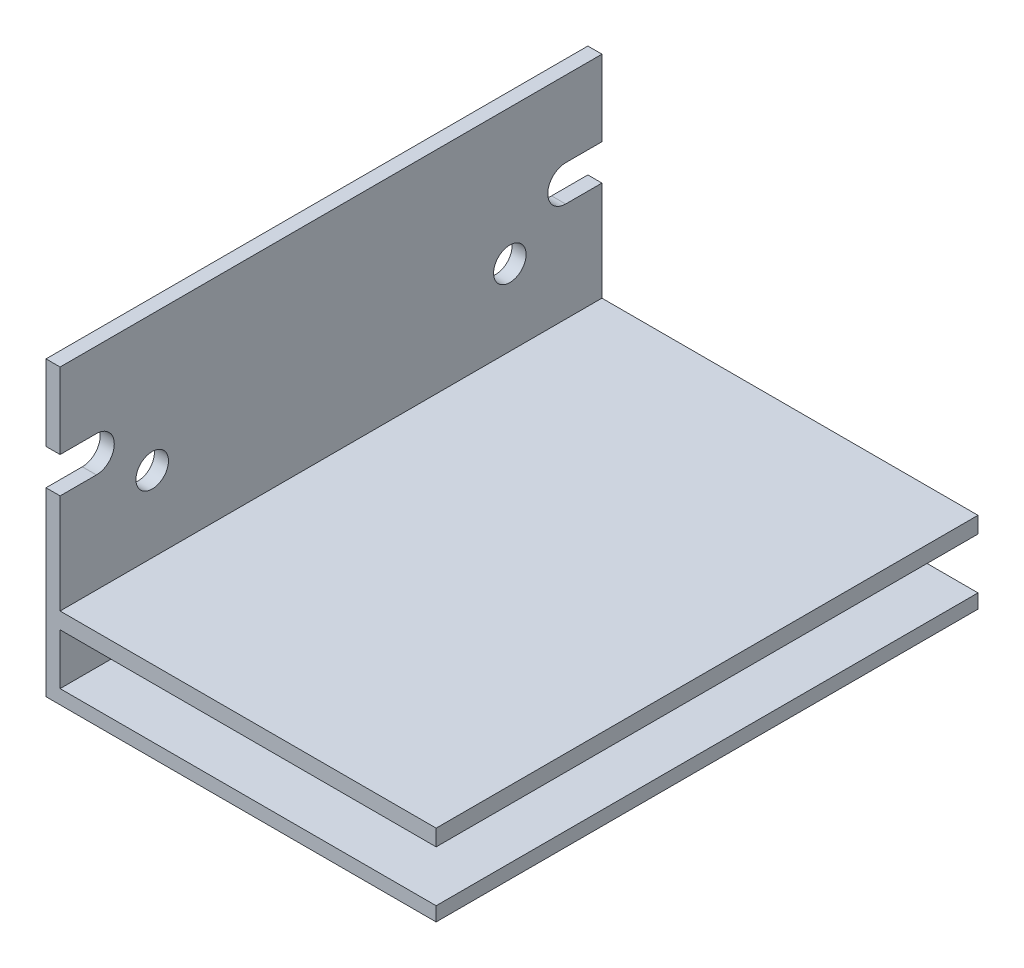
ISO-10303-21;
HEADER;
FILE_DESCRIPTION(('STEP AP214'),'2;1');
FILE_NAME('part.step','',(''),(''),'','','');
FILE_SCHEMA(('AUTOMOTIVE_DESIGN { 1 0 10303 214 1 1 1 1 }'));
ENDSEC;
DATA;
#1=APPLICATION_CONTEXT('core data for automotive mechanical design processes');
#2=APPLICATION_PROTOCOL_DEFINITION('international standard','automotive_design',2000,#1);
#3=PRODUCT_CONTEXT('',#1,'mechanical');
#4=PRODUCT('Part','Part','',(#3));
#5=PRODUCT_RELATED_PRODUCT_CATEGORY('part','',(#4));
#6=PRODUCT_DEFINITION_FORMATION('','',#4);
#7=PRODUCT_DEFINITION_CONTEXT('part definition',#1,'design');
#8=PRODUCT_DEFINITION('design','',#6,#7);
#9=PRODUCT_DEFINITION_SHAPE('','',#8);
#10=(LENGTH_UNIT() NAMED_UNIT(*) SI_UNIT(.MILLI.,.METRE.));
#11=(NAMED_UNIT(*) PLANE_ANGLE_UNIT() SI_UNIT($,.RADIAN.));
#12=(NAMED_UNIT(*) SI_UNIT($,.STERADIAN.) SOLID_ANGLE_UNIT());
#13=UNCERTAINTY_MEASURE_WITH_UNIT(LENGTH_MEASURE(1.E-05),#10,'distance_accuracy_value','');
#14=(GEOMETRIC_REPRESENTATION_CONTEXT(3) GLOBAL_UNCERTAINTY_ASSIGNED_CONTEXT((#13)) GLOBAL_UNIT_ASSIGNED_CONTEXT((#10,
#11,#12)) REPRESENTATION_CONTEXT('',''));
#15=CARTESIAN_POINT('',(0.,0.,0.));
#16=DIRECTION('',(0.,0.,1.));
#17=DIRECTION('',(1.,0.,0.));
#18=AXIS2_PLACEMENT_3D('',#15,#16,#17);
#19=CARTESIAN_POINT('',(0.,0.,50.));
#20=DIRECTION('',(0.,0.,-1.));
#21=DIRECTION('',(-1.,0.,0.));
#22=AXIS2_PLACEMENT_3D('',#19,#20,#21);
#23=PLANE('',#22);
#24=DIRECTION('',(0.,-1.,0.));
#25=VECTOR('',#24,1.);
#26=CARTESIAN_POINT('',(0.,0.,50.));
#27=LINE('',#26,#25);
#28=CARTESIAN_POINT('',(0.,27.,50.));
#29=VERTEX_POINT('',#28);
#30=CARTESIAN_POINT('',(0.,20.,50.));
#31=VERTEX_POINT('',#30);
#32=EDGE_CURVE('E242',#29,#31,#27,.T.);
#33=ORIENTED_EDGE('',*,*,#32,.T.);
#34=DIRECTION('',(1.,0.,0.));
#35=VECTOR('',#34,1.);
#36=CARTESIAN_POINT('',(0.,20.,50.));
#37=LINE('',#36,#35);
#38=CARTESIAN_POINT('',(1.3,20.,50.));
#39=VERTEX_POINT('',#38);
#40=EDGE_CURVE('E11',#31,#39,#37,.T.);
#41=ORIENTED_EDGE('',*,*,#40,.T.);
#42=DIRECTION('',(0.,1.,0.));
#43=VECTOR('',#42,1.);
#44=CARTESIAN_POINT('',(1.3,27.,50.));
#45=LINE('',#44,#43);
#46=CARTESIAN_POINT('',(1.3,27.,50.));
#47=VERTEX_POINT('',#46);
#48=EDGE_CURVE('E236',#39,#47,#45,.T.);
#49=ORIENTED_EDGE('',*,*,#48,.T.);
#50=DIRECTION('',(-1.,0.,0.));
#51=VECTOR('',#50,1.);
#52=CARTESIAN_POINT('',(0.,27.,50.));
#53=LINE('',#52,#51);
#54=EDGE_CURVE('E240',#47,#29,#53,.T.);
#55=ORIENTED_EDGE('',*,*,#54,.T.);
#56=EDGE_LOOP('',(#33,#41,#49,#55));
#57=FACE_BOUND('',#56,.T.);
#58=ADVANCED_FACE('F35',(#57),#23,.F.);
#59=CARTESIAN_POINT('',(0.,0.,0.));
#60=DIRECTION('',(0.,0.,-1.));
#61=DIRECTION('',(-1.,0.,0.));
#62=AXIS2_PLACEMENT_3D('',#59,#60,#61);
#63=PLANE('',#62);
#64=DIRECTION('',(1.,0.,0.));
#65=VECTOR('',#64,1.);
#66=CARTESIAN_POINT('',(0.,20.,0.));
#67=LINE('',#66,#65);
#68=CARTESIAN_POINT('',(0.,20.,0.));
#69=VERTEX_POINT('',#68);
#70=CARTESIAN_POINT('',(1.3,20.,0.));
#71=VERTEX_POINT('',#70);
#72=EDGE_CURVE('E300',#69,#71,#67,.T.);
#73=ORIENTED_EDGE('',*,*,#72,.F.);
#74=DIRECTION('',(0.,-1.,0.));
#75=VECTOR('',#74,1.);
#76=CARTESIAN_POINT('',(0.,0.,0.));
#77=LINE('',#76,#75);
#78=CARTESIAN_POINT('',(0.,27.,0.));
#79=VERTEX_POINT('',#78);
#80=EDGE_CURVE('E224',#79,#69,#77,.T.);
#81=ORIENTED_EDGE('',*,*,#80,.F.);
#82=DIRECTION('',(-1.,0.,0.));
#83=VECTOR('',#82,1.);
#84=CARTESIAN_POINT('',(0.,27.,0.));
#85=LINE('',#84,#83);
#86=CARTESIAN_POINT('',(1.3,27.,0.));
#87=VERTEX_POINT('',#86);
#88=EDGE_CURVE('E264',#87,#79,#85,.T.);
#89=ORIENTED_EDGE('',*,*,#88,.F.);
#90=DIRECTION('',(0.,1.,0.));
#91=VECTOR('',#90,1.);
#92=CARTESIAN_POINT('',(1.3,27.,0.));
#93=LINE('',#92,#91);
#94=EDGE_CURVE('E260',#71,#87,#93,.T.);
#95=ORIENTED_EDGE('',*,*,#94,.F.);
#96=EDGE_LOOP('',(#73,#81,#89,#95));
#97=FACE_BOUND('',#96,.T.);
#98=ADVANCED_FACE('F321',(#97),#63,.T.);
#99=CARTESIAN_POINT('',(36.,0.,50.));
#100=DIRECTION('',(0.,1.,0.));
#101=DIRECTION('',(-1.,0.,0.));
#102=AXIS2_PLACEMENT_3D('',#99,#100,#101);
#103=PLANE('',#102);
#104=DIRECTION('',(1.,0.,0.));
#105=VECTOR('',#104,1.);
#106=CARTESIAN_POINT('',(36.,0.,0.));
#107=LINE('',#106,#105);
#108=CARTESIAN_POINT('',(0.,0.,0.));
#109=VERTEX_POINT('',#108);
#110=CARTESIAN_POINT('',(36.,0.,0.));
#111=VERTEX_POINT('',#110);
#112=EDGE_CURVE('E219',#109,#111,#107,.T.);
#113=ORIENTED_EDGE('',*,*,#112,.T.);
#114=DIRECTION('',(0.,0.,-1.));
#115=VECTOR('',#114,1.);
#116=CARTESIAN_POINT('',(36.,0.,50.));
#117=LINE('',#116,#115);
#118=CARTESIAN_POINT('',(36.,0.,50.));
#119=VERTEX_POINT('',#118);
#120=EDGE_CURVE('E295',#119,#111,#117,.T.);
#121=ORIENTED_EDGE('',*,*,#120,.F.);
#122=DIRECTION('',(1.,0.,0.));
#123=VECTOR('',#122,1.);
#124=CARTESIAN_POINT('',(36.,0.,50.));
#125=LINE('',#124,#123);
#126=CARTESIAN_POINT('',(0.,0.,50.));
#127=VERTEX_POINT('',#126);
#128=EDGE_CURVE('E220',#127,#119,#125,.T.);
#129=ORIENTED_EDGE('',*,*,#128,.F.);
#130=DIRECTION('',(0.,0.,-1.));
#131=VECTOR('',#130,1.);
#132=CARTESIAN_POINT('',(0.,0.,50.));
#133=LINE('',#132,#131);
#134=EDGE_CURVE('E245',#127,#109,#133,.T.);
#135=ORIENTED_EDGE('',*,*,#134,.T.);
#136=EDGE_LOOP('',(#113,#121,#129,#135));
#137=FACE_BOUND('',#136,.T.);
#138=ADVANCED_FACE('F37',(#137),#103,.F.);
#139=CARTESIAN_POINT('',(36.,1.3,50.));
#140=DIRECTION('',(-1.,0.,0.));
#141=DIRECTION('',(0.,0.,1.));
#142=AXIS2_PLACEMENT_3D('',#139,#140,#141);
#143=PLANE('',#142);
#144=DIRECTION('',(0.,1.,0.));
#145=VECTOR('',#144,1.);
#146=CARTESIAN_POINT('',(36.,1.3,0.));
#147=LINE('',#146,#145);
#148=CARTESIAN_POINT('',(36.,1.3,0.));
#149=VERTEX_POINT('',#148);
#150=EDGE_CURVE('E248',#111,#149,#147,.T.);
#151=ORIENTED_EDGE('',*,*,#150,.T.);
#152=DIRECTION('',(0.,0.,-1.));
#153=VECTOR('',#152,1.);
#154=CARTESIAN_POINT('',(36.,1.3,50.));
#155=LINE('',#154,#153);
#156=CARTESIAN_POINT('',(36.,1.3,50.));
#157=VERTEX_POINT('',#156);
#158=EDGE_CURVE('E292',#157,#149,#155,.T.);
#159=ORIENTED_EDGE('',*,*,#158,.F.);
#160=DIRECTION('',(0.,1.,0.));
#161=VECTOR('',#160,1.);
#162=CARTESIAN_POINT('',(36.,1.3,50.));
#163=LINE('',#162,#161);
#164=EDGE_CURVE('E223',#119,#157,#163,.T.);
#165=ORIENTED_EDGE('',*,*,#164,.F.);
#166=ORIENTED_EDGE('',*,*,#120,.T.);
#167=EDGE_LOOP('',(#151,#159,#165,#166));
#168=FACE_BOUND('',#167,.T.);
#169=ADVANCED_FACE('F344',(#168),#143,.F.);
#170=CARTESIAN_POINT('',(1.3,1.3,50.));
#171=DIRECTION('',(0.,-1.,0.));
#172=DIRECTION('',(1.,0.,0.));
#173=AXIS2_PLACEMENT_3D('',#170,#171,#172);
#174=PLANE('',#173);
#175=DIRECTION('',(-1.,0.,0.));
#176=VECTOR('',#175,1.);
#177=CARTESIAN_POINT('',(1.3,1.3,0.));
#178=LINE('',#177,#176);
#179=CARTESIAN_POINT('',(1.3,1.3,0.));
#180=VERTEX_POINT('',#179);
#181=EDGE_CURVE('E250',#149,#180,#178,.T.);
#182=ORIENTED_EDGE('',*,*,#181,.T.);
#183=DIRECTION('',(0.,0.,-1.));
#184=VECTOR('',#183,1.);
#185=CARTESIAN_POINT('',(1.3,1.3,50.));
#186=LINE('',#185,#184);
#187=CARTESIAN_POINT('',(1.3,1.3,50.));
#188=VERTEX_POINT('',#187);
#189=EDGE_CURVE('E289',#188,#180,#186,.T.);
#190=ORIENTED_EDGE('',*,*,#189,.F.);
#191=DIRECTION('',(-1.,0.,0.));
#192=VECTOR('',#191,1.);
#193=CARTESIAN_POINT('',(1.3,1.3,50.));
#194=LINE('',#193,#192);
#195=EDGE_CURVE('E226',#157,#188,#194,.T.);
#196=ORIENTED_EDGE('',*,*,#195,.F.);
#197=ORIENTED_EDGE('',*,*,#158,.T.);
#198=EDGE_LOOP('',(#182,#190,#196,#197));
#199=FACE_BOUND('',#198,.T.);
#200=ADVANCED_FACE('F346',(#199),#174,.F.);
#201=CARTESIAN_POINT('',(1.3,6.,50.));
#202=DIRECTION('',(-1.,0.,0.));
#203=DIRECTION('',(0.,-1.,0.));
#204=AXIS2_PLACEMENT_3D('',#201,#202,#203);
#205=PLANE('',#204);
#206=DIRECTION('',(0.,1.,0.));
#207=VECTOR('',#206,1.);
#208=CARTESIAN_POINT('',(1.3,6.,0.));
#209=LINE('',#208,#207);
#210=CARTESIAN_POINT('',(1.3,6.,0.));
#211=VERTEX_POINT('',#210);
#212=EDGE_CURVE('E252',#180,#211,#209,.T.);
#213=ORIENTED_EDGE('',*,*,#212,.T.);
#214=DIRECTION('',(0.,0.,-1.));
#215=VECTOR('',#214,1.);
#216=CARTESIAN_POINT('',(1.3,6.,50.));
#217=LINE('',#216,#215);
#218=CARTESIAN_POINT('',(1.3,6.,50.));
#219=VERTEX_POINT('',#218);
#220=EDGE_CURVE('E286',#219,#211,#217,.T.);
#221=ORIENTED_EDGE('',*,*,#220,.F.);
#222=DIRECTION('',(0.,1.,0.));
#223=VECTOR('',#222,1.);
#224=CARTESIAN_POINT('',(1.3,6.,50.));
#225=LINE('',#224,#223);
#226=EDGE_CURVE('E228',#188,#219,#225,.T.);
#227=ORIENTED_EDGE('',*,*,#226,.F.);
#228=ORIENTED_EDGE('',*,*,#189,.T.);
#229=EDGE_LOOP('',(#213,#221,#227,#228));
#230=FACE_BOUND('',#229,.T.);
#231=ADVANCED_FACE('F351',(#230),#205,.F.);
#232=CARTESIAN_POINT('',(36.,6.,50.));
#233=DIRECTION('',(0.,1.,0.));
#234=DIRECTION('',(-1.,0.,0.));
#235=AXIS2_PLACEMENT_3D('',#232,#233,#234);
#236=PLANE('',#235);
#237=DIRECTION('',(1.,0.,0.));
#238=VECTOR('',#237,1.);
#239=CARTESIAN_POINT('',(36.,6.,0.));
#240=LINE('',#239,#238);
#241=CARTESIAN_POINT('',(36.,6.,0.));
#242=VERTEX_POINT('',#241);
#243=EDGE_CURVE('E254',#211,#242,#240,.T.);
#244=ORIENTED_EDGE('',*,*,#243,.T.);
#245=DIRECTION('',(0.,0.,-1.));
#246=VECTOR('',#245,1.);
#247=CARTESIAN_POINT('',(36.,6.,50.));
#248=LINE('',#247,#246);
#249=CARTESIAN_POINT('',(36.,6.,50.));
#250=VERTEX_POINT('',#249);
#251=EDGE_CURVE('E283',#250,#242,#248,.T.);
#252=ORIENTED_EDGE('',*,*,#251,.F.);
#253=DIRECTION('',(1.,0.,0.));
#254=VECTOR('',#253,1.);
#255=CARTESIAN_POINT('',(36.,6.,50.));
#256=LINE('',#255,#254);
#257=EDGE_CURVE('E230',#219,#250,#256,.T.);
#258=ORIENTED_EDGE('',*,*,#257,.F.);
#259=ORIENTED_EDGE('',*,*,#220,.T.);
#260=EDGE_LOOP('',(#244,#252,#258,#259));
#261=FACE_BOUND('',#260,.T.);
#262=ADVANCED_FACE('F357',(#261),#236,.F.);
#263=CARTESIAN_POINT('',(36.,6.,50.));
#264=DIRECTION('',(-1.,0.,0.));
#265=DIRECTION('',(0.,0.,1.));
#266=AXIS2_PLACEMENT_3D('',#263,#264,#265);
#267=PLANE('',#266);
#268=DIRECTION('',(0.,1.,0.));
#269=VECTOR('',#268,1.);
#270=CARTESIAN_POINT('',(36.,6.,0.));
#271=LINE('',#270,#269);
#272=CARTESIAN_POINT('',(36.,7.5,0.));
#273=VERTEX_POINT('',#272);
#274=EDGE_CURVE('E256',#242,#273,#271,.T.);
#275=ORIENTED_EDGE('',*,*,#274,.T.);
#276=DIRECTION('',(0.,0.,-1.));
#277=VECTOR('',#276,1.);
#278=CARTESIAN_POINT('',(36.,7.5,50.));
#279=LINE('',#278,#277);
#280=CARTESIAN_POINT('',(36.,7.5,50.));
#281=VERTEX_POINT('',#280);
#282=EDGE_CURVE('E280',#281,#273,#279,.T.);
#283=ORIENTED_EDGE('',*,*,#282,.F.);
#284=DIRECTION('',(0.,1.,0.));
#285=VECTOR('',#284,1.);
#286=CARTESIAN_POINT('',(36.,6.,50.));
#287=LINE('',#286,#285);
#288=EDGE_CURVE('E232',#250,#281,#287,.T.);
#289=ORIENTED_EDGE('',*,*,#288,.F.);
#290=ORIENTED_EDGE('',*,*,#251,.T.);
#291=EDGE_LOOP('',(#275,#283,#289,#290));
#292=FACE_BOUND('',#291,.T.);
#293=ADVANCED_FACE('F361',(#292),#267,.F.);
#294=CARTESIAN_POINT('',(36.,7.5,50.));
#295=DIRECTION('',(0.,-1.,0.));
#296=DIRECTION('',(1.,0.,0.));
#297=AXIS2_PLACEMENT_3D('',#294,#295,#296);
#298=PLANE('',#297);
#299=DIRECTION('',(-1.,0.,0.));
#300=VECTOR('',#299,1.);
#301=CARTESIAN_POINT('',(36.,7.5,0.));
#302=LINE('',#301,#300);
#303=CARTESIAN_POINT('',(1.3,7.5,0.));
#304=VERTEX_POINT('',#303);
#305=EDGE_CURVE('E258',#273,#304,#302,.T.);
#306=ORIENTED_EDGE('',*,*,#305,.T.);
#307=DIRECTION('',(0.,0.,-1.));
#308=VECTOR('',#307,1.);
#309=CARTESIAN_POINT('',(1.3,7.5,50.));
#310=LINE('',#309,#308);
#311=CARTESIAN_POINT('',(1.3,7.5,50.));
#312=VERTEX_POINT('',#311);
#313=EDGE_CURVE('E277',#312,#304,#310,.T.);
#314=ORIENTED_EDGE('',*,*,#313,.F.);
#315=DIRECTION('',(-1.,0.,0.));
#316=VECTOR('',#315,1.);
#317=CARTESIAN_POINT('',(36.,7.5,50.));
#318=LINE('',#317,#316);
#319=EDGE_CURVE('E234',#281,#312,#318,.T.);
#320=ORIENTED_EDGE('',*,*,#319,.F.);
#321=ORIENTED_EDGE('',*,*,#282,.T.);
#322=EDGE_LOOP('',(#306,#314,#320,#321));
#323=FACE_BOUND('',#322,.T.);
#324=ADVANCED_FACE('F366',(#323),#298,.F.);
#325=CARTESIAN_POINT('',(1.3,27.,50.));
#326=DIRECTION('',(-1.,0.,0.));
#327=DIRECTION('',(0.,-1.,0.));
#328=AXIS2_PLACEMENT_3D('',#325,#326,#327);
#329=PLANE('',#328);
#330=CARTESIAN_POINT('',(1.3,14.5,8.5));
#331=DIRECTION('',(-1.,0.,0.));
#332=DIRECTION('',(0.,-1.,0.));
#333=AXIS2_PLACEMENT_3D('',#330,#331,#332);
#334=CIRCLE('',#333,1.5);
#335=CARTESIAN_POINT('',(1.3,13.,8.5));
#336=VERTEX_POINT('',#335);
#337=EDGE_CURVE('E197',#336,#336,#334,.T.);
#338=ORIENTED_EDGE('',*,*,#337,.T.);
#339=EDGE_LOOP('',(#338));
#340=FACE_BOUND('',#339,.T.);
#341=CARTESIAN_POINT('',(1.3,14.5,41.5));
#342=DIRECTION('',(-1.,0.,0.));
#343=DIRECTION('',(0.,-1.,0.));
#344=AXIS2_PLACEMENT_3D('',#341,#342,#343);
#345=CIRCLE('',#344,1.5);
#346=CARTESIAN_POINT('',(1.3,13.,41.5));
#347=VERTEX_POINT('',#346);
#348=EDGE_CURVE('E194',#347,#347,#345,.T.);
#349=ORIENTED_EDGE('',*,*,#348,.T.);
#350=EDGE_LOOP('',(#349));
#351=FACE_BOUND('',#350,.T.);
#352=ORIENTED_EDGE('',*,*,#48,.F.);
#353=DIRECTION('',(0.,0.,-1.));
#354=VECTOR('',#353,1.);
#355=CARTESIAN_POINT('',(1.3,20.,50.));
#356=LINE('',#355,#354);
#357=CARTESIAN_POINT('',(1.3,20.,46.65));
#358=VERTEX_POINT('',#357);
#359=EDGE_CURVE('E188',#39,#358,#356,.T.);
#360=ORIENTED_EDGE('',*,*,#359,.T.);
#361=CARTESIAN_POINT('',(1.3,18.35,46.65));
#362=DIRECTION('',(-1.,0.,0.));
#363=DIRECTION('',(0.,-1.,0.));
#364=AXIS2_PLACEMENT_3D('',#361,#362,#363);
#365=CIRCLE('',#364,1.65);
#366=CARTESIAN_POINT('',(1.3,16.7,46.65));
#367=VERTEX_POINT('',#366);
#368=EDGE_CURVE('E192',#358,#367,#365,.T.);
#369=ORIENTED_EDGE('',*,*,#368,.T.);
#370=DIRECTION('',(0.,0.,1.));
#371=VECTOR('',#370,1.);
#372=CARTESIAN_POINT('',(1.3,16.7,50.));
#373=LINE('',#372,#371);
#374=CARTESIAN_POINT('',(1.3,16.7,50.));
#375=VERTEX_POINT('',#374);
#376=EDGE_CURVE('E163',#367,#375,#373,.T.);
#377=ORIENTED_EDGE('',*,*,#376,.T.);
#378=EDGE_CURVE('E237',#312,#375,#45,.T.);
#379=ORIENTED_EDGE('',*,*,#378,.F.);
#380=ORIENTED_EDGE('',*,*,#313,.T.);
#381=CARTESIAN_POINT('',(1.3,16.7,0.));
#382=VERTEX_POINT('',#381);
#383=EDGE_CURVE('E261',#304,#382,#93,.T.);
#384=ORIENTED_EDGE('',*,*,#383,.T.);
#385=DIRECTION('',(0.,0.,1.));
#386=VECTOR('',#385,1.);
#387=CARTESIAN_POINT('',(1.3,16.7,50.));
#388=LINE('',#387,#386);
#389=CARTESIAN_POINT('',(1.3,16.7,3.35));
#390=VERTEX_POINT('',#389);
#391=EDGE_CURVE('E58',#382,#390,#388,.T.);
#392=ORIENTED_EDGE('',*,*,#391,.T.);
#393=CARTESIAN_POINT('',(1.3,18.35,3.35));
#394=DIRECTION('',(-1.,0.,0.));
#395=DIRECTION('',(0.,-1.,0.));
#396=AXIS2_PLACEMENT_3D('',#393,#394,#395);
#397=CIRCLE('',#396,1.65);
#398=CARTESIAN_POINT('',(1.3,20.,3.35));
#399=VERTEX_POINT('',#398);
#400=EDGE_CURVE('E216',#390,#399,#397,.T.);
#401=ORIENTED_EDGE('',*,*,#400,.T.);
#402=DIRECTION('',(0.,0.,-1.));
#403=VECTOR('',#402,1.);
#404=CARTESIAN_POINT('',(1.3,20.,50.));
#405=LINE('',#404,#403);
#406=EDGE_CURVE('E213',#399,#71,#405,.T.);
#407=ORIENTED_EDGE('',*,*,#406,.T.);
#408=ORIENTED_EDGE('',*,*,#94,.T.);
#409=DIRECTION('',(0.,0.,-1.));
#410=VECTOR('',#409,1.);
#411=CARTESIAN_POINT('',(1.3,27.,50.));
#412=LINE('',#411,#410);
#413=EDGE_CURVE('E274',#47,#87,#412,.T.);
#414=ORIENTED_EDGE('',*,*,#413,.F.);
#415=EDGE_LOOP('',(#352,#360,#369,#377,#379,#380,#384,#392,#401,#407,#408,#414));
#416=FACE_BOUND('',#415,.T.);
#417=ADVANCED_FACE('F306',(#340,#351,#416),#329,.F.);
#418=CARTESIAN_POINT('',(0.,27.,50.));
#419=DIRECTION('',(0.,-1.,0.));
#420=DIRECTION('',(0.,0.,-1.));
#421=AXIS2_PLACEMENT_3D('',#418,#419,#420);
#422=PLANE('',#421);
#423=ORIENTED_EDGE('',*,*,#88,.T.);
#424=DIRECTION('',(0.,0.,-1.));
#425=VECTOR('',#424,1.);
#426=CARTESIAN_POINT('',(0.,27.,50.));
#427=LINE('',#426,#425);
#428=EDGE_CURVE('E271',#29,#79,#427,.T.);
#429=ORIENTED_EDGE('',*,*,#428,.F.);
#430=ORIENTED_EDGE('',*,*,#54,.F.);
#431=ORIENTED_EDGE('',*,*,#413,.T.);
#432=EDGE_LOOP('',(#423,#429,#430,#431));
#433=FACE_BOUND('',#432,.T.);
#434=ADVANCED_FACE('F315',(#433),#422,.F.);
#435=CARTESIAN_POINT('',(0.,0.,50.));
#436=DIRECTION('',(1.,0.,0.));
#437=DIRECTION('',(0.,0.,-1.));
#438=AXIS2_PLACEMENT_3D('',#435,#436,#437);
#439=PLANE('',#438);
#440=CARTESIAN_POINT('',(0.,14.5,8.5));
#441=DIRECTION('',(-1.,0.,0.));
#442=DIRECTION('',(0.,0.,1.));
#443=AXIS2_PLACEMENT_3D('',#440,#441,#442);
#444=CIRCLE('',#443,1.5);
#445=CARTESIAN_POINT('',(0.,14.5,10.));
#446=VERTEX_POINT('',#445);
#447=EDGE_CURVE('E189',#446,#446,#444,.T.);
#448=ORIENTED_EDGE('',*,*,#447,.F.);
#449=EDGE_LOOP('',(#448));
#450=FACE_BOUND('',#449,.T.);
#451=CARTESIAN_POINT('',(0.,14.5,41.5));
#452=DIRECTION('',(-1.,0.,0.));
#453=DIRECTION('',(0.,0.,-1.));
#454=AXIS2_PLACEMENT_3D('',#451,#452,#453);
#455=CIRCLE('',#454,1.5);
#456=CARTESIAN_POINT('',(0.,14.5,40.));
#457=VERTEX_POINT('',#456);
#458=EDGE_CURVE('E185',#457,#457,#455,.T.);
#459=ORIENTED_EDGE('',*,*,#458,.F.);
#460=EDGE_LOOP('',(#459));
#461=FACE_BOUND('',#460,.T.);
#462=CARTESIAN_POINT('',(0.,18.35,46.65));
#463=DIRECTION('',(-1.,0.,0.));
#464=DIRECTION('',(0.,0.,1.));
#465=AXIS2_PLACEMENT_3D('',#462,#463,#464);
#466=CIRCLE('',#465,1.65);
#467=CARTESIAN_POINT('',(0.,20.,46.65));
#468=VERTEX_POINT('',#467);
#469=CARTESIAN_POINT('',(0.,16.7,46.65));
#470=VERTEX_POINT('',#469);
#471=EDGE_CURVE('E170',#468,#470,#466,.T.);
#472=ORIENTED_EDGE('',*,*,#471,.F.);
#473=DIRECTION('',(0.,0.,-1.));
#474=VECTOR('',#473,1.);
#475=CARTESIAN_POINT('',(0.,20.,50.));
#476=LINE('',#475,#474);
#477=EDGE_CURVE('E167',#31,#468,#476,.T.);
#478=ORIENTED_EDGE('',*,*,#477,.F.);
#479=ORIENTED_EDGE('',*,*,#32,.F.);
#480=ORIENTED_EDGE('',*,*,#428,.T.);
#481=ORIENTED_EDGE('',*,*,#80,.T.);
#482=DIRECTION('',(0.,0.,-1.));
#483=VECTOR('',#482,1.);
#484=CARTESIAN_POINT('',(0.,20.,0.));
#485=LINE('',#484,#483);
#486=CARTESIAN_POINT('',(0.,20.,3.35));
#487=VERTEX_POINT('',#486);
#488=EDGE_CURVE('E206',#487,#69,#485,.T.);
#489=ORIENTED_EDGE('',*,*,#488,.F.);
#490=CARTESIAN_POINT('',(0.,18.35,3.35));
#491=DIRECTION('',(-1.,0.,0.));
#492=DIRECTION('',(0.,0.,-1.));
#493=AXIS2_PLACEMENT_3D('',#490,#491,#492);
#494=CIRCLE('',#493,1.65);
#495=CARTESIAN_POINT('',(0.,16.7,3.35));
#496=VERTEX_POINT('',#495);
#497=EDGE_CURVE('E203',#496,#487,#494,.T.);
#498=ORIENTED_EDGE('',*,*,#497,.F.);
#499=DIRECTION('',(0.,0.,1.));
#500=VECTOR('',#499,1.);
#501=CARTESIAN_POINT('',(0.,16.7,3.35));
#502=LINE('',#501,#500);
#503=CARTESIAN_POINT('',(0.,16.7,0.));
#504=VERTEX_POINT('',#503);
#505=EDGE_CURVE('E200',#504,#496,#502,.T.);
#506=ORIENTED_EDGE('',*,*,#505,.F.);
#507=EDGE_CURVE('E266',#504,#109,#77,.T.);
#508=ORIENTED_EDGE('',*,*,#507,.T.);
#509=ORIENTED_EDGE('',*,*,#134,.F.);
#510=CARTESIAN_POINT('',(0.,16.7,50.));
#511=VERTEX_POINT('',#510);
#512=EDGE_CURVE('E180',#511,#127,#27,.T.);
#513=ORIENTED_EDGE('',*,*,#512,.F.);
#514=DIRECTION('',(0.,0.,1.));
#515=VECTOR('',#514,1.);
#516=CARTESIAN_POINT('',(0.,16.7,46.65));
#517=LINE('',#516,#515);
#518=EDGE_CURVE('E50',#470,#511,#517,.T.);
#519=ORIENTED_EDGE('',*,*,#518,.F.);
#520=EDGE_LOOP('',(#472,#478,#479,#480,#481,#489,#498,#506,#508,#509,#513,#519));
#521=FACE_BOUND('',#520,.T.);
#522=ADVANCED_FACE('F178',(#450,#461,#521),#439,.F.);
#523=ORIENTED_EDGE('',*,*,#378,.T.);
#524=DIRECTION('',(-1.,0.,0.));
#525=VECTOR('',#524,1.);
#526=CARTESIAN_POINT('',(0.,16.7,50.));
#527=LINE('',#526,#525);
#528=EDGE_CURVE('E43',#375,#511,#527,.T.);
#529=ORIENTED_EDGE('',*,*,#528,.T.);
#530=ORIENTED_EDGE('',*,*,#512,.T.);
#531=ORIENTED_EDGE('',*,*,#128,.T.);
#532=ORIENTED_EDGE('',*,*,#164,.T.);
#533=ORIENTED_EDGE('',*,*,#195,.T.);
#534=ORIENTED_EDGE('',*,*,#226,.T.);
#535=ORIENTED_EDGE('',*,*,#257,.T.);
#536=ORIENTED_EDGE('',*,*,#288,.T.);
#537=ORIENTED_EDGE('',*,*,#319,.T.);
#538=EDGE_LOOP('',(#523,#529,#530,#531,#532,#533,#534,#535,#536,#537));
#539=FACE_BOUND('',#538,.T.);
#540=ADVANCED_FACE('F302',(#539),#23,.F.);
#541=DIRECTION('',(-1.,0.,0.));
#542=VECTOR('',#541,1.);
#543=CARTESIAN_POINT('',(0.,16.7,0.));
#544=LINE('',#543,#542);
#545=EDGE_CURVE('E298',#382,#504,#544,.T.);
#546=ORIENTED_EDGE('',*,*,#545,.F.);
#547=ORIENTED_EDGE('',*,*,#383,.F.);
#548=ORIENTED_EDGE('',*,*,#305,.F.);
#549=ORIENTED_EDGE('',*,*,#274,.F.);
#550=ORIENTED_EDGE('',*,*,#243,.F.);
#551=ORIENTED_EDGE('',*,*,#212,.F.);
#552=ORIENTED_EDGE('',*,*,#181,.F.);
#553=ORIENTED_EDGE('',*,*,#150,.F.);
#554=ORIENTED_EDGE('',*,*,#112,.F.);
#555=ORIENTED_EDGE('',*,*,#507,.F.);
#556=EDGE_LOOP('',(#546,#547,#548,#549,#550,#551,#552,#553,#554,#555));
#557=FACE_BOUND('',#556,.T.);
#558=ADVANCED_FACE('F334',(#557),#63,.T.);
#559=CARTESIAN_POINT('',(50.,18.35,3.35));
#560=DIRECTION('',(-1.,0.,0.));
#561=DIRECTION('',(0.,0.,1.));
#562=AXIS2_PLACEMENT_3D('',#559,#560,#561);
#563=CYLINDRICAL_SURFACE('',#562,1.65);
#564=DIRECTION('',(-1.,0.,0.));
#565=VECTOR('',#564,1.);
#566=CARTESIAN_POINT('',(50.,16.7,3.35));
#567=LINE('',#566,#565);
#568=EDGE_CURVE('E208',#390,#496,#567,.T.);
#569=ORIENTED_EDGE('',*,*,#568,.T.);
#570=ORIENTED_EDGE('',*,*,#497,.T.);
#571=DIRECTION('',(-1.,0.,0.));
#572=VECTOR('',#571,1.);
#573=CARTESIAN_POINT('',(50.,20.,3.35));
#574=LINE('',#573,#572);
#575=EDGE_CURVE('E209',#399,#487,#574,.T.);
#576=ORIENTED_EDGE('',*,*,#575,.F.);
#577=ORIENTED_EDGE('',*,*,#400,.F.);
#578=EDGE_LOOP('',(#569,#570,#576,#577));
#579=FACE_BOUND('',#578,.T.);
#580=ADVANCED_FACE('F327',(#579),#563,.F.);
#581=CARTESIAN_POINT('',(50.,20.,0.));
#582=DIRECTION('',(0.,1.,0.));
#583=DIRECTION('',(0.,0.,1.));
#584=AXIS2_PLACEMENT_3D('',#581,#582,#583);
#585=PLANE('',#584);
#586=ORIENTED_EDGE('',*,*,#575,.T.);
#587=ORIENTED_EDGE('',*,*,#488,.T.);
#588=ORIENTED_EDGE('',*,*,#72,.T.);
#589=ORIENTED_EDGE('',*,*,#406,.F.);
#590=EDGE_LOOP('',(#586,#587,#588,#589));
#591=FACE_BOUND('',#590,.T.);
#592=ADVANCED_FACE('F324',(#591),#585,.F.);
#593=CARTESIAN_POINT('',(50.,16.7,3.35));
#594=DIRECTION('',(0.,-1.,0.));
#595=DIRECTION('',(0.,0.,-1.));
#596=AXIS2_PLACEMENT_3D('',#593,#594,#595);
#597=PLANE('',#596);
#598=ORIENTED_EDGE('',*,*,#545,.T.);
#599=ORIENTED_EDGE('',*,*,#505,.T.);
#600=ORIENTED_EDGE('',*,*,#568,.F.);
#601=ORIENTED_EDGE('',*,*,#391,.F.);
#602=EDGE_LOOP('',(#598,#599,#600,#601));
#603=FACE_BOUND('',#602,.T.);
#604=ADVANCED_FACE('F328',(#603),#597,.F.);
#605=CARTESIAN_POINT('',(50.,18.35,46.65));
#606=DIRECTION('',(-1.,0.,0.));
#607=DIRECTION('',(0.,0.,1.));
#608=AXIS2_PLACEMENT_3D('',#605,#606,#607);
#609=CYLINDRICAL_SURFACE('',#608,1.65);
#610=DIRECTION('',(-1.,0.,0.));
#611=VECTOR('',#610,1.);
#612=CARTESIAN_POINT('',(50.,20.,46.65));
#613=LINE('',#612,#611);
#614=EDGE_CURVE('E166',#358,#468,#613,.T.);
#615=ORIENTED_EDGE('',*,*,#614,.T.);
#616=ORIENTED_EDGE('',*,*,#471,.T.);
#617=DIRECTION('',(-1.,0.,0.));
#618=VECTOR('',#617,1.);
#619=CARTESIAN_POINT('',(50.,16.7,46.65));
#620=LINE('',#619,#618);
#621=EDGE_CURVE('E159',#367,#470,#620,.T.);
#622=ORIENTED_EDGE('',*,*,#621,.F.);
#623=ORIENTED_EDGE('',*,*,#368,.F.);
#624=EDGE_LOOP('',(#615,#616,#622,#623));
#625=FACE_BOUND('',#624,.T.);
#626=ADVANCED_FACE('F171',(#625),#609,.F.);
#627=CARTESIAN_POINT('',(50.,20.,50.));
#628=DIRECTION('',(0.,1.,0.));
#629=DIRECTION('',(0.,0.,1.));
#630=AXIS2_PLACEMENT_3D('',#627,#628,#629);
#631=PLANE('',#630);
#632=ORIENTED_EDGE('',*,*,#40,.F.);
#633=ORIENTED_EDGE('',*,*,#477,.T.);
#634=ORIENTED_EDGE('',*,*,#614,.F.);
#635=ORIENTED_EDGE('',*,*,#359,.F.);
#636=EDGE_LOOP('',(#632,#633,#634,#635));
#637=FACE_BOUND('',#636,.T.);
#638=ADVANCED_FACE('F308',(#637),#631,.F.);
#639=CARTESIAN_POINT('',(50.,16.7,46.65));
#640=DIRECTION('',(0.,-1.,0.));
#641=DIRECTION('',(0.,0.,-1.));
#642=AXIS2_PLACEMENT_3D('',#639,#640,#641);
#643=PLANE('',#642);
#644=ORIENTED_EDGE('',*,*,#621,.T.);
#645=ORIENTED_EDGE('',*,*,#518,.T.);
#646=ORIENTED_EDGE('',*,*,#528,.F.);
#647=ORIENTED_EDGE('',*,*,#376,.F.);
#648=EDGE_LOOP('',(#644,#645,#646,#647));
#649=FACE_BOUND('',#648,.T.);
#650=ADVANCED_FACE('F161',(#649),#643,.F.);
#651=CARTESIAN_POINT('',(50.,14.5,41.5));
#652=DIRECTION('',(-1.,0.,0.));
#653=DIRECTION('',(0.,0.,1.));
#654=AXIS2_PLACEMENT_3D('',#651,#652,#653);
#655=CYLINDRICAL_SURFACE('',#654,1.5);
#656=ORIENTED_EDGE('',*,*,#458,.T.);
#657=EDGE_LOOP('',(#656));
#658=FACE_BOUND('',#657,.T.);
#659=ORIENTED_EDGE('',*,*,#348,.F.);
#660=EDGE_LOOP('',(#659));
#661=FACE_BOUND('',#660,.T.);
#662=ADVANCED_FACE('F405',(#658,#661),#655,.F.);
#663=CARTESIAN_POINT('',(50.,14.5,8.5));
#664=DIRECTION('',(-1.,0.,0.));
#665=DIRECTION('',(0.,0.,1.));
#666=AXIS2_PLACEMENT_3D('',#663,#664,#665);
#667=CYLINDRICAL_SURFACE('',#666,1.5);
#668=ORIENTED_EDGE('',*,*,#447,.T.);
#669=EDGE_LOOP('',(#668));
#670=FACE_BOUND('',#669,.T.);
#671=ORIENTED_EDGE('',*,*,#337,.F.);
#672=EDGE_LOOP('',(#671));
#673=FACE_BOUND('',#672,.T.);
#674=ADVANCED_FACE('F402',(#670,#673),#667,.F.);
#675=CLOSED_SHELL('',(#58,#98,#138,#169,#200,#231,#262,#293,#324,#417,#434,#522,#540,#558,#580,
#592,#604,#626,#638,#650,#662,#674));
#676=MANIFOLD_SOLID_BREP('B2',#675);
#677=ADVANCED_BREP_SHAPE_REPRESENTATION('',(#18,#676),#14);
#678=SHAPE_DEFINITION_REPRESENTATION(#9,#677);
ENDSEC;
END-ISO-10303-21;
